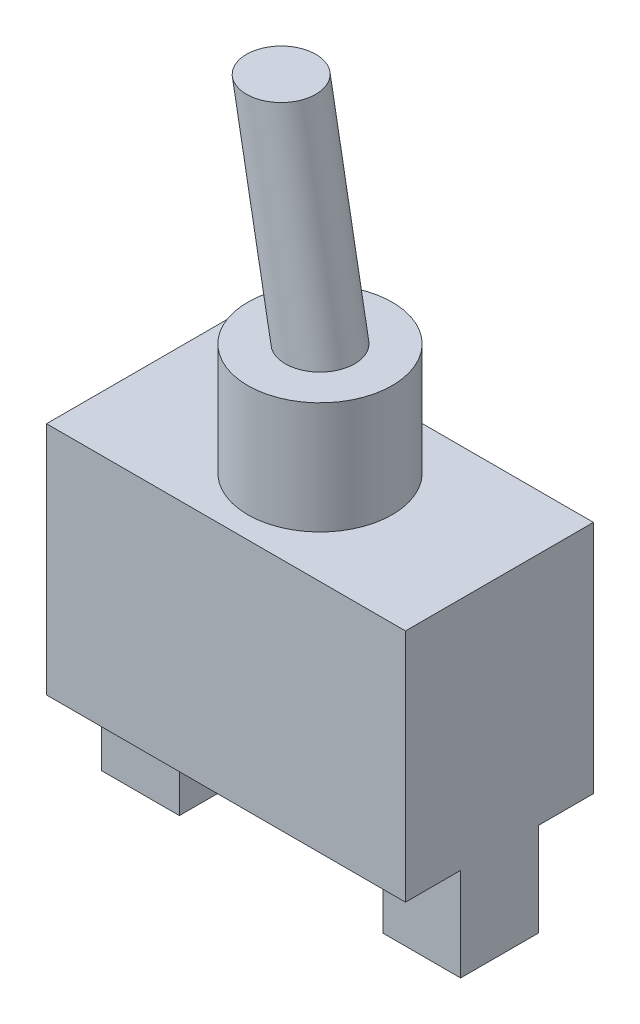
ISO-10303-21;
HEADER;
FILE_DESCRIPTION(('STEP AP214'),'2;1');
FILE_NAME('part.step','',(''),(''),'','','');
FILE_SCHEMA(('AUTOMOTIVE_DESIGN { 1 0 10303 214 1 1 1 1 }'));
ENDSEC;
DATA;
#1=APPLICATION_CONTEXT('core data for automotive mechanical design processes');
#2=APPLICATION_PROTOCOL_DEFINITION('international standard','automotive_design',2000,#1);
#3=PRODUCT_CONTEXT('',#1,'mechanical');
#4=PRODUCT('Part','Part','',(#3));
#5=PRODUCT_RELATED_PRODUCT_CATEGORY('part','',(#4));
#6=PRODUCT_DEFINITION_FORMATION('','',#4);
#7=PRODUCT_DEFINITION_CONTEXT('part definition',#1,'design');
#8=PRODUCT_DEFINITION('design','',#6,#7);
#9=PRODUCT_DEFINITION_SHAPE('','',#8);
#10=(LENGTH_UNIT() NAMED_UNIT(*) SI_UNIT(.MILLI.,.METRE.));
#11=(NAMED_UNIT(*) PLANE_ANGLE_UNIT() SI_UNIT($,.RADIAN.));
#12=(NAMED_UNIT(*) SI_UNIT($,.STERADIAN.) SOLID_ANGLE_UNIT());
#13=UNCERTAINTY_MEASURE_WITH_UNIT(LENGTH_MEASURE(1.E-05),#10,'distance_accuracy_value','');
#14=(GEOMETRIC_REPRESENTATION_CONTEXT(3) GLOBAL_UNCERTAINTY_ASSIGNED_CONTEXT((#13)) GLOBAL_UNIT_ASSIGNED_CONTEXT((#10,
#11,#12)) REPRESENTATION_CONTEXT('',''));
#15=CARTESIAN_POINT('',(0.,0.,0.));
#16=DIRECTION('',(0.,0.,1.));
#17=DIRECTION('',(1.,0.,0.));
#18=AXIS2_PLACEMENT_3D('',#15,#16,#17);
#19=CARTESIAN_POINT('',(0.,0.,0.));
#20=DIRECTION('',(0.,-1.,0.));
#21=DIRECTION('',(0.,0.,-1.));
#22=AXIS2_PLACEMENT_3D('',#19,#20,#21);
#23=PLANE('',#22);
#24=DIRECTION('',(0.,0.,-1.));
#25=VECTOR('',#24,1.);
#26=CARTESIAN_POINT('',(8.3185,0.,3.175));
#27=LINE('',#26,#25);
#28=CARTESIAN_POINT('',(8.3185,0.,3.175));
#29=VERTEX_POINT('',#28);
#30=CARTESIAN_POINT('',(8.3185,0.,-3.175));
#31=VERTEX_POINT('',#30);
#32=EDGE_CURVE('E439',#29,#31,#27,.T.);
#33=ORIENTED_EDGE('',*,*,#32,.F.);
#34=DIRECTION('',(-1.,0.,0.));
#35=VECTOR('',#34,1.);
#36=CARTESIAN_POINT('',(14.6685,0.,3.175));
#37=LINE('',#36,#35);
#38=CARTESIAN_POINT('',(14.6685,0.,3.175));
#39=VERTEX_POINT('',#38);
#40=EDGE_CURVE('E438',#39,#29,#37,.T.);
#41=ORIENTED_EDGE('',*,*,#40,.F.);
#42=DIRECTION('',(0.,0.,-1.));
#43=VECTOR('',#42,1.);
#44=CARTESIAN_POINT('',(14.6685,0.,7.6835));
#45=LINE('',#44,#43);
#46=CARTESIAN_POINT('',(14.6685,0.,7.6835));
#47=VERTEX_POINT('',#46);
#48=EDGE_CURVE('E157',#47,#39,#45,.T.);
#49=ORIENTED_EDGE('',*,*,#48,.F.);
#50=DIRECTION('',(1.,0.,0.));
#51=VECTOR('',#50,1.);
#52=CARTESIAN_POINT('',(-14.6685,0.,7.6835));
#53=LINE('',#52,#51);
#54=CARTESIAN_POINT('',(-14.6685,0.,7.6835));
#55=VERTEX_POINT('',#54);
#56=EDGE_CURVE('E215',#55,#47,#53,.T.);
#57=ORIENTED_EDGE('',*,*,#56,.F.);
#58=DIRECTION('',(0.,0.,1.));
#59=VECTOR('',#58,1.);
#60=CARTESIAN_POINT('',(-14.6685,0.,7.6835));
#61=LINE('',#60,#59);
#62=CARTESIAN_POINT('',(-14.6685,0.,3.175));
#63=VERTEX_POINT('',#62);
#64=EDGE_CURVE('E230',#63,#55,#61,.T.);
#65=ORIENTED_EDGE('',*,*,#64,.F.);
#66=DIRECTION('',(-1.,0.,0.));
#67=VECTOR('',#66,1.);
#68=CARTESIAN_POINT('',(-14.6685,0.,3.175));
#69=LINE('',#68,#67);
#70=CARTESIAN_POINT('',(-8.3185,0.,3.175));
#71=VERTEX_POINT('',#70);
#72=EDGE_CURVE('E65',#71,#63,#69,.T.);
#73=ORIENTED_EDGE('',*,*,#72,.F.);
#74=DIRECTION('',(0.,0.,1.));
#75=VECTOR('',#74,1.);
#76=CARTESIAN_POINT('',(-8.3185,0.,3.175));
#77=LINE('',#76,#75);
#78=CARTESIAN_POINT('',(-8.3185,0.,-3.175));
#79=VERTEX_POINT('',#78);
#80=EDGE_CURVE('E164',#79,#71,#77,.T.);
#81=ORIENTED_EDGE('',*,*,#80,.F.);
#82=DIRECTION('',(1.,0.,0.));
#83=VECTOR('',#82,1.);
#84=CARTESIAN_POINT('',(-14.6685,0.,-3.175));
#85=LINE('',#84,#83);
#86=CARTESIAN_POINT('',(-14.6685,0.,-3.175));
#87=VERTEX_POINT('',#86);
#88=EDGE_CURVE('E159',#87,#79,#85,.T.);
#89=ORIENTED_EDGE('',*,*,#88,.F.);
#90=CARTESIAN_POINT('',(-14.6685,0.,-7.6835));
#91=VERTEX_POINT('',#90);
#92=EDGE_CURVE('E231',#91,#87,#61,.T.);
#93=ORIENTED_EDGE('',*,*,#92,.F.);
#94=DIRECTION('',(-1.,0.,0.));
#95=VECTOR('',#94,1.);
#96=CARTESIAN_POINT('',(-14.6685,0.,-7.6835));
#97=LINE('',#96,#95);
#98=CARTESIAN_POINT('',(14.6685,0.,-7.6835));
#99=VERTEX_POINT('',#98);
#100=EDGE_CURVE('E227',#99,#91,#97,.T.);
#101=ORIENTED_EDGE('',*,*,#100,.F.);
#102=CARTESIAN_POINT('',(14.6685,0.,-3.175));
#103=VERTEX_POINT('',#102);
#104=EDGE_CURVE('E206',#103,#99,#45,.T.);
#105=ORIENTED_EDGE('',*,*,#104,.F.);
#106=DIRECTION('',(1.,0.,0.));
#107=VECTOR('',#106,1.);
#108=CARTESIAN_POINT('',(14.6685,0.,-3.175));
#109=LINE('',#108,#107);
#110=EDGE_CURVE('E152',#31,#103,#109,.T.);
#111=ORIENTED_EDGE('',*,*,#110,.F.);
#112=EDGE_LOOP('',(#33,#41,#49,#57,#65,#73,#81,#89,#93,#101,#105,#111));
#113=FACE_BOUND('',#112,.T.);
#114=ADVANCED_FACE('F39',(#113),#23,.T.);
#115=CARTESIAN_POINT('',(14.6685,19.2024,7.6835));
#116=DIRECTION('',(-1.,0.,0.));
#117=DIRECTION('',(0.,0.,1.));
#118=AXIS2_PLACEMENT_3D('',#115,#116,#117);
#119=PLANE('',#118);
#120=ORIENTED_EDGE('',*,*,#48,.T.);
#121=DIRECTION('',(0.,1.,0.));
#122=VECTOR('',#121,1.);
#123=CARTESIAN_POINT('',(14.6685,-7.62,3.175));
#124=LINE('',#123,#122);
#125=CARTESIAN_POINT('',(14.6685,-7.62,3.175));
#126=VERTEX_POINT('',#125);
#127=EDGE_CURVE('E135',#126,#39,#124,.T.);
#128=ORIENTED_EDGE('',*,*,#127,.F.);
#129=DIRECTION('',(0.,0.,1.));
#130=VECTOR('',#129,1.);
#131=CARTESIAN_POINT('',(14.6685,-7.62,3.175));
#132=LINE('',#131,#130);
#133=CARTESIAN_POINT('',(14.6685,-7.62,-3.175));
#134=VERTEX_POINT('',#133);
#135=EDGE_CURVE('E143',#134,#126,#132,.T.);
#136=ORIENTED_EDGE('',*,*,#135,.F.);
#137=DIRECTION('',(0.,1.,0.));
#138=VECTOR('',#137,1.);
#139=CARTESIAN_POINT('',(14.6685,-7.62,-3.175));
#140=LINE('',#139,#138);
#141=EDGE_CURVE('E257',#134,#103,#140,.T.);
#142=ORIENTED_EDGE('',*,*,#141,.T.);
#143=ORIENTED_EDGE('',*,*,#104,.T.);
#144=DIRECTION('',(0.,-1.,0.));
#145=VECTOR('',#144,1.);
#146=CARTESIAN_POINT('',(14.6685,19.2024,-7.6835));
#147=LINE('',#146,#145);
#148=CARTESIAN_POINT('',(14.6685,19.2024,-7.6835));
#149=VERTEX_POINT('',#148);
#150=EDGE_CURVE('E43',#149,#99,#147,.T.);
#151=ORIENTED_EDGE('',*,*,#150,.F.);
#152=DIRECTION('',(0.,0.,-1.));
#153=VECTOR('',#152,1.);
#154=CARTESIAN_POINT('',(14.6685,19.2024,7.6835));
#155=LINE('',#154,#153);
#156=CARTESIAN_POINT('',(14.6685,19.2024,7.6835));
#157=VERTEX_POINT('',#156);
#158=EDGE_CURVE('E210',#157,#149,#155,.T.);
#159=ORIENTED_EDGE('',*,*,#158,.F.);
#160=DIRECTION('',(0.,-1.,0.));
#161=VECTOR('',#160,1.);
#162=CARTESIAN_POINT('',(14.6685,19.2024,7.6835));
#163=LINE('',#162,#161);
#164=EDGE_CURVE('E224',#157,#47,#163,.T.);
#165=ORIENTED_EDGE('',*,*,#164,.T.);
#166=EDGE_LOOP('',(#120,#128,#136,#142,#143,#151,#159,#165));
#167=FACE_BOUND('',#166,.T.);
#168=ADVANCED_FACE('F41',(#167),#119,.F.);
#169=CARTESIAN_POINT('',(-14.6685,19.2024,-7.6835));
#170=DIRECTION('',(0.,0.,1.));
#171=DIRECTION('',(1.,0.,0.));
#172=AXIS2_PLACEMENT_3D('',#169,#170,#171);
#173=PLANE('',#172);
#174=ORIENTED_EDGE('',*,*,#100,.T.);
#175=DIRECTION('',(0.,-1.,0.));
#176=VECTOR('',#175,1.);
#177=CARTESIAN_POINT('',(-14.6685,19.2024,-7.6835));
#178=LINE('',#177,#176);
#179=CARTESIAN_POINT('',(-14.6685,19.2024,-7.6835));
#180=VERTEX_POINT('',#179);
#181=EDGE_CURVE('E242',#180,#91,#178,.T.);
#182=ORIENTED_EDGE('',*,*,#181,.F.);
#183=DIRECTION('',(-1.,0.,0.));
#184=VECTOR('',#183,1.);
#185=CARTESIAN_POINT('',(-14.6685,19.2024,-7.6835));
#186=LINE('',#185,#184);
#187=EDGE_CURVE('E214',#149,#180,#186,.T.);
#188=ORIENTED_EDGE('',*,*,#187,.F.);
#189=ORIENTED_EDGE('',*,*,#150,.T.);
#190=EDGE_LOOP('',(#174,#182,#188,#189));
#191=FACE_BOUND('',#190,.T.);
#192=ADVANCED_FACE('F253',(#191),#173,.F.);
#193=CARTESIAN_POINT('',(-14.6685,19.2024,7.6835));
#194=DIRECTION('',(1.,0.,0.));
#195=DIRECTION('',(0.,0.,-1.));
#196=AXIS2_PLACEMENT_3D('',#193,#194,#195);
#197=PLANE('',#196);
#198=ORIENTED_EDGE('',*,*,#92,.T.);
#199=DIRECTION('',(0.,1.,0.));
#200=VECTOR('',#199,1.);
#201=CARTESIAN_POINT('',(-14.6685,-7.62,-3.175));
#202=LINE('',#201,#200);
#203=CARTESIAN_POINT('',(-14.6685,-7.62,-3.175));
#204=VERTEX_POINT('',#203);
#205=EDGE_CURVE('E198',#204,#87,#202,.T.);
#206=ORIENTED_EDGE('',*,*,#205,.F.);
#207=DIRECTION('',(0.,0.,-1.));
#208=VECTOR('',#207,1.);
#209=CARTESIAN_POINT('',(-14.6685,-7.62,3.175));
#210=LINE('',#209,#208);
#211=CARTESIAN_POINT('',(-14.6685,-7.62,3.175));
#212=VERTEX_POINT('',#211);
#213=EDGE_CURVE('E169',#212,#204,#210,.T.);
#214=ORIENTED_EDGE('',*,*,#213,.F.);
#215=DIRECTION('',(0.,1.,0.));
#216=VECTOR('',#215,1.);
#217=CARTESIAN_POINT('',(-14.6685,-7.62,3.175));
#218=LINE('',#217,#216);
#219=EDGE_CURVE('E181',#212,#63,#218,.T.);
#220=ORIENTED_EDGE('',*,*,#219,.T.);
#221=ORIENTED_EDGE('',*,*,#64,.T.);
#222=DIRECTION('',(0.,-1.,0.));
#223=VECTOR('',#222,1.);
#224=CARTESIAN_POINT('',(-14.6685,19.2024,7.6835));
#225=LINE('',#224,#223);
#226=CARTESIAN_POINT('',(-14.6685,19.2024,7.6835));
#227=VERTEX_POINT('',#226);
#228=EDGE_CURVE('E239',#227,#55,#225,.T.);
#229=ORIENTED_EDGE('',*,*,#228,.F.);
#230=DIRECTION('',(0.,0.,1.));
#231=VECTOR('',#230,1.);
#232=CARTESIAN_POINT('',(-14.6685,19.2024,7.6835));
#233=LINE('',#232,#231);
#234=EDGE_CURVE('E218',#180,#227,#233,.T.);
#235=ORIENTED_EDGE('',*,*,#234,.F.);
#236=ORIENTED_EDGE('',*,*,#181,.T.);
#237=EDGE_LOOP('',(#198,#206,#214,#220,#221,#229,#235,#236));
#238=FACE_BOUND('',#237,.T.);
#239=ADVANCED_FACE('F262',(#238),#197,.F.);
#240=CARTESIAN_POINT('',(-14.6685,19.2024,7.6835));
#241=DIRECTION('',(0.,0.,-1.));
#242=DIRECTION('',(-1.,0.,0.));
#243=AXIS2_PLACEMENT_3D('',#240,#241,#242);
#244=PLANE('',#243);
#245=ORIENTED_EDGE('',*,*,#56,.T.);
#246=ORIENTED_EDGE('',*,*,#164,.F.);
#247=DIRECTION('',(1.,0.,0.));
#248=VECTOR('',#247,1.);
#249=CARTESIAN_POINT('',(-14.6685,19.2024,7.6835));
#250=LINE('',#249,#248);
#251=EDGE_CURVE('E221',#227,#157,#250,.T.);
#252=ORIENTED_EDGE('',*,*,#251,.F.);
#253=ORIENTED_EDGE('',*,*,#228,.T.);
#254=EDGE_LOOP('',(#245,#246,#252,#253));
#255=FACE_BOUND('',#254,.T.);
#256=ADVANCED_FACE('F296',(#255),#244,.F.);
#257=CARTESIAN_POINT('',(0.,19.2024,0.));
#258=DIRECTION('',(0.,-1.,0.));
#259=DIRECTION('',(0.,0.,-1.));
#260=AXIS2_PLACEMENT_3D('',#257,#258,#259);
#261=PLANE('',#260);
#262=CARTESIAN_POINT('',(0.,19.2024,0.));
#263=DIRECTION('',(0.,1.,0.));
#264=DIRECTION('',(0.,0.,1.));
#265=AXIS2_PLACEMENT_3D('',#262,#263,#264);
#266=CIRCLE('',#265,5.9055);
#267=CARTESIAN_POINT('',(0.,19.2024,5.9055));
#268=VERTEX_POINT('',#267);
#269=EDGE_CURVE('E49',#268,#268,#266,.T.);
#270=ORIENTED_EDGE('',*,*,#269,.F.);
#271=EDGE_LOOP('',(#270));
#272=FACE_BOUND('',#271,.T.);
#273=ORIENTED_EDGE('',*,*,#158,.T.);
#274=ORIENTED_EDGE('',*,*,#187,.T.);
#275=ORIENTED_EDGE('',*,*,#234,.T.);
#276=ORIENTED_EDGE('',*,*,#251,.T.);
#277=EDGE_LOOP('',(#273,#274,#275,#276));
#278=FACE_BOUND('',#277,.T.);
#279=ADVANCED_FACE('F294',(#272,#278),#261,.F.);
#280=CARTESIAN_POINT('',(0.,28.3464,0.));
#281=DIRECTION('',(0.,-1.,0.));
#282=DIRECTION('',(0.,0.,-1.));
#283=AXIS2_PLACEMENT_3D('',#280,#281,#282);
#284=CYLINDRICAL_SURFACE('',#283,5.9055);
#285=CARTESIAN_POINT('',(0.,28.3464,0.));
#286=DIRECTION('',(0.,1.,0.));
#287=DIRECTION('',(0.,0.,1.));
#288=AXIS2_PLACEMENT_3D('',#285,#286,#287);
#289=CIRCLE('',#288,5.9055);
#290=CARTESIAN_POINT('',(0.,28.3464,5.9055));
#291=VERTEX_POINT('',#290);
#292=EDGE_CURVE('E202',#291,#291,#289,.T.);
#293=ORIENTED_EDGE('',*,*,#292,.F.);
#294=EDGE_LOOP('',(#293));
#295=FACE_BOUND('',#294,.T.);
#296=ORIENTED_EDGE('',*,*,#269,.T.);
#297=EDGE_LOOP('',(#296));
#298=FACE_BOUND('',#297,.T.);
#299=ADVANCED_FACE('F321',(#295,#298),#284,.T.);
#300=CARTESIAN_POINT('',(0.,28.3464,0.));
#301=DIRECTION('',(0.,1.,0.));
#302=DIRECTION('',(0.,0.,1.));
#303=AXIS2_PLACEMENT_3D('',#300,#301,#302);
#304=PLANE('',#303);
#305=CARTESIAN_POINT('',(0.,28.3464,0.));
#306=DIRECTION('',(0.,1.,0.));
#307=DIRECTION('',(0.,0.,1.));
#308=AXIS2_PLACEMENT_3D('',#305,#306,#307);
#309=CIRCLE('',#308,2.8321);
#310=CARTESIAN_POINT('',(0.,28.3464,2.8321));
#311=VERTEX_POINT('',#310);
#312=EDGE_CURVE('E11',#311,#311,#309,.T.);
#313=ORIENTED_EDGE('',*,*,#312,.F.);
#314=EDGE_LOOP('',(#313));
#315=FACE_BOUND('',#314,.T.);
#316=ORIENTED_EDGE('',*,*,#292,.T.);
#317=EDGE_LOOP('',(#316));
#318=FACE_BOUND('',#317,.T.);
#319=ADVANCED_FACE('F285',(#315,#318),#304,.T.);
#320=CARTESIAN_POINT('',(-14.6685,-7.62,-3.175));
#321=DIRECTION('',(0.,0.,1.));
#322=DIRECTION('',(1.,0.,0.));
#323=AXIS2_PLACEMENT_3D('',#320,#321,#322);
#324=PLANE('',#323);
#325=ORIENTED_EDGE('',*,*,#88,.T.);
#326=DIRECTION('',(0.,1.,0.));
#327=VECTOR('',#326,1.);
#328=CARTESIAN_POINT('',(-8.3185,-7.62,-3.175));
#329=LINE('',#328,#327);
#330=CARTESIAN_POINT('',(-8.3185,-7.62,-3.175));
#331=VERTEX_POINT('',#330);
#332=EDGE_CURVE('E194',#331,#79,#329,.T.);
#333=ORIENTED_EDGE('',*,*,#332,.F.);
#334=DIRECTION('',(1.,0.,0.));
#335=VECTOR('',#334,1.);
#336=CARTESIAN_POINT('',(-14.6685,-7.62,-3.175));
#337=LINE('',#336,#335);
#338=EDGE_CURVE('E173',#204,#331,#337,.T.);
#339=ORIENTED_EDGE('',*,*,#338,.F.);
#340=ORIENTED_EDGE('',*,*,#205,.T.);
#341=EDGE_LOOP('',(#325,#333,#339,#340));
#342=FACE_BOUND('',#341,.T.);
#343=ADVANCED_FACE('F265',(#342),#324,.F.);
#344=CARTESIAN_POINT('',(-8.3185,-7.62,3.175));
#345=DIRECTION('',(-1.,0.,0.));
#346=DIRECTION('',(0.,0.,1.));
#347=AXIS2_PLACEMENT_3D('',#344,#345,#346);
#348=PLANE('',#347);
#349=ORIENTED_EDGE('',*,*,#80,.T.);
#350=DIRECTION('',(0.,1.,0.));
#351=VECTOR('',#350,1.);
#352=CARTESIAN_POINT('',(-8.3185,-7.62,3.175));
#353=LINE('',#352,#351);
#354=CARTESIAN_POINT('',(-8.3185,-7.62,3.175));
#355=VERTEX_POINT('',#354);
#356=EDGE_CURVE('E190',#355,#71,#353,.T.);
#357=ORIENTED_EDGE('',*,*,#356,.F.);
#358=DIRECTION('',(0.,0.,1.));
#359=VECTOR('',#358,1.);
#360=CARTESIAN_POINT('',(-8.3185,-7.62,3.175));
#361=LINE('',#360,#359);
#362=EDGE_CURVE('E176',#331,#355,#361,.T.);
#363=ORIENTED_EDGE('',*,*,#362,.F.);
#364=ORIENTED_EDGE('',*,*,#332,.T.);
#365=EDGE_LOOP('',(#349,#357,#363,#364));
#366=FACE_BOUND('',#365,.T.);
#367=ADVANCED_FACE('F277',(#366),#348,.F.);
#368=CARTESIAN_POINT('',(-14.6685,-7.62,3.175));
#369=DIRECTION('',(0.,0.,-1.));
#370=DIRECTION('',(-1.,0.,0.));
#371=AXIS2_PLACEMENT_3D('',#368,#369,#370);
#372=PLANE('',#371);
#373=ORIENTED_EDGE('',*,*,#72,.T.);
#374=ORIENTED_EDGE('',*,*,#219,.F.);
#375=DIRECTION('',(-1.,0.,0.));
#376=VECTOR('',#375,1.);
#377=CARTESIAN_POINT('',(-14.6685,-7.62,3.175));
#378=LINE('',#377,#376);
#379=EDGE_CURVE('E179',#355,#212,#378,.T.);
#380=ORIENTED_EDGE('',*,*,#379,.F.);
#381=ORIENTED_EDGE('',*,*,#356,.T.);
#382=EDGE_LOOP('',(#373,#374,#380,#381));
#383=FACE_BOUND('',#382,.T.);
#384=ADVANCED_FACE('F274',(#383),#372,.F.);
#385=CARTESIAN_POINT('',(0.,-7.62,0.));
#386=DIRECTION('',(0.,-1.,0.));
#387=DIRECTION('',(0.,0.,-1.));
#388=AXIS2_PLACEMENT_3D('',#385,#386,#387);
#389=PLANE('',#388);
#390=ORIENTED_EDGE('',*,*,#213,.T.);
#391=ORIENTED_EDGE('',*,*,#338,.T.);
#392=ORIENTED_EDGE('',*,*,#362,.T.);
#393=ORIENTED_EDGE('',*,*,#379,.T.);
#394=EDGE_LOOP('',(#390,#391,#392,#393));
#395=FACE_BOUND('',#394,.T.);
#396=ADVANCED_FACE('F269',(#395),#389,.T.);
#397=CARTESIAN_POINT('',(14.6685,-7.62,3.175));
#398=DIRECTION('',(0.,0.,-1.));
#399=DIRECTION('',(-1.,0.,0.));
#400=AXIS2_PLACEMENT_3D('',#397,#398,#399);
#401=PLANE('',#400);
#402=ORIENTED_EDGE('',*,*,#40,.T.);
#403=DIRECTION('',(0.,1.,0.));
#404=VECTOR('',#403,1.);
#405=CARTESIAN_POINT('',(8.3185,-7.62,3.175));
#406=LINE('',#405,#404);
#407=CARTESIAN_POINT('',(8.3185,-7.62,3.175));
#408=VERTEX_POINT('',#407);
#409=EDGE_CURVE('E138',#408,#29,#406,.T.);
#410=ORIENTED_EDGE('',*,*,#409,.F.);
#411=DIRECTION('',(-1.,0.,0.));
#412=VECTOR('',#411,1.);
#413=CARTESIAN_POINT('',(14.6685,-7.62,3.175));
#414=LINE('',#413,#412);
#415=EDGE_CURVE('E131',#126,#408,#414,.T.);
#416=ORIENTED_EDGE('',*,*,#415,.F.);
#417=ORIENTED_EDGE('',*,*,#127,.T.);
#418=EDGE_LOOP('',(#402,#410,#416,#417));
#419=FACE_BOUND('',#418,.T.);
#420=ADVANCED_FACE('F133',(#419),#401,.F.);
#421=CARTESIAN_POINT('',(8.3185,-7.62,3.175));
#422=DIRECTION('',(1.,0.,0.));
#423=DIRECTION('',(0.,0.,-1.));
#424=AXIS2_PLACEMENT_3D('',#421,#422,#423);
#425=PLANE('',#424);
#426=ORIENTED_EDGE('',*,*,#32,.T.);
#427=DIRECTION('',(0.,1.,0.));
#428=VECTOR('',#427,1.);
#429=CARTESIAN_POINT('',(8.3185,-7.62,-3.175));
#430=LINE('',#429,#428);
#431=CARTESIAN_POINT('',(8.3185,-7.62,-3.175));
#432=VERTEX_POINT('',#431);
#433=EDGE_CURVE('E57',#432,#31,#430,.T.);
#434=ORIENTED_EDGE('',*,*,#433,.F.);
#435=DIRECTION('',(0.,0.,-1.));
#436=VECTOR('',#435,1.);
#437=CARTESIAN_POINT('',(8.3185,-7.62,3.175));
#438=LINE('',#437,#436);
#439=EDGE_CURVE('E142',#408,#432,#438,.T.);
#440=ORIENTED_EDGE('',*,*,#439,.F.);
#441=ORIENTED_EDGE('',*,*,#409,.T.);
#442=EDGE_LOOP('',(#426,#434,#440,#441));
#443=FACE_BOUND('',#442,.T.);
#444=ADVANCED_FACE('F370',(#443),#425,.F.);
#445=CARTESIAN_POINT('',(14.6685,-7.62,-3.175));
#446=DIRECTION('',(0.,0.,1.));
#447=DIRECTION('',(1.,0.,0.));
#448=AXIS2_PLACEMENT_3D('',#445,#446,#447);
#449=PLANE('',#448);
#450=ORIENTED_EDGE('',*,*,#110,.T.);
#451=ORIENTED_EDGE('',*,*,#141,.F.);
#452=DIRECTION('',(1.,0.,0.));
#453=VECTOR('',#452,1.);
#454=CARTESIAN_POINT('',(14.6685,-7.62,-3.175));
#455=LINE('',#454,#453);
#456=EDGE_CURVE('E147',#432,#134,#455,.T.);
#457=ORIENTED_EDGE('',*,*,#456,.F.);
#458=ORIENTED_EDGE('',*,*,#433,.T.);
#459=EDGE_LOOP('',(#450,#451,#457,#458));
#460=FACE_BOUND('',#459,.T.);
#461=ADVANCED_FACE('F379',(#460),#449,.F.);
#462=CARTESIAN_POINT('',(0.,-7.62,0.));
#463=DIRECTION('',(0.,1.,0.));
#464=DIRECTION('',(0.,0.,1.));
#465=AXIS2_PLACEMENT_3D('',#462,#463,#464);
#466=PLANE('',#465);
#467=ORIENTED_EDGE('',*,*,#135,.T.);
#468=ORIENTED_EDGE('',*,*,#415,.T.);
#469=ORIENTED_EDGE('',*,*,#439,.T.);
#470=ORIENTED_EDGE('',*,*,#456,.T.);
#471=EDGE_LOOP('',(#467,#468,#469,#470));
#472=FACE_BOUND('',#471,.T.);
#473=ADVANCED_FACE('F146',(#472),#466,.F.);
#474=CARTESIAN_POINT('',(-3.175,45.840621188724,0.));
#475=DIRECTION('',(0.,1.,0.));
#476=DIRECTION('',(0.,0.,1.));
#477=AXIS2_PLACEMENT_3D('',#474,#475,#476);
#478=PLANE('',#477);
#479=CARTESIAN_POINT('',(-3.175,45.840621188724,0.));
#480=DIRECTION('',(0.,1.,0.));
#481=DIRECTION('',(0.,0.,1.));
#482=AXIS2_PLACEMENT_3D('',#479,#480,#481);
#483=CIRCLE('',#482,2.8321);
#484=CARTESIAN_POINT('',(-3.175,45.840621188724,2.8321));
#485=VERTEX_POINT('',#484);
#486=EDGE_CURVE('E428',#485,#485,#483,.T.);
#487=ORIENTED_EDGE('',*,*,#486,.T.);
#488=EDGE_LOOP('',(#487));
#489=FACE_BOUND('',#488,.T.);
#490=ADVANCED_FACE('F395',(#489),#478,.T.);
#491=CARTESIAN_POINT('',(0.,28.3464,2.8321));
#492=CARTESIAN_POINT('',(-3.175,45.840621188724,2.8321));
#493=CARTESIAN_POINT('',(5.6642,28.3464,2.8321));
#494=CARTESIAN_POINT('',(2.4892,45.840621188724,2.8321));
#495=CARTESIAN_POINT('',(5.6642,28.3464,-2.8321));
#496=CARTESIAN_POINT('',(2.4892,45.840621188724,-2.8321));
#497=CARTESIAN_POINT('',(0.,28.3464,-2.8321));
#498=CARTESIAN_POINT('',(-3.175,45.840621188724,-2.8321));
#499=CARTESIAN_POINT('',(-5.6642,28.3464,-2.8321));
#500=CARTESIAN_POINT('',(-8.8392,45.840621188724,-2.8321));
#501=CARTESIAN_POINT('',(-5.6642,28.3464,2.8321));
#502=CARTESIAN_POINT('',(-8.8392,45.840621188724,2.8321));
#503=CARTESIAN_POINT('',(0.,28.3464,2.8321));
#504=CARTESIAN_POINT('',(-3.175,45.840621188724,2.8321));
#505=(BOUNDED_SURFACE() B_SPLINE_SURFACE(3,1,((#491,#492),(#493,#494),(#495,#496),(#497,#498),
(#499,#500),(#501,#502),(#503,#504)),.UNSPECIFIED.,.T.,.F.,.F.) B_SPLINE_SURFACE_WITH_KNOTS((4,
3,4),(2,2),(0.,0.5,1.),(0.,1.),
.UNSPECIFIED.) GEOMETRIC_REPRESENTATION_ITEM() RATIONAL_B_SPLINE_SURFACE(((1.,1.),
(0.333333333333333,0.333333333333333),(0.333333333333333,0.333333333333333),(1.,1.),
(0.333333333333333,0.333333333333333),(0.333333333333333,0.333333333333333),(1.,1.))) REPRESENTATION_ITEM('') SURFACE());
#506=CARTESIAN_POINT('',(-3.175,45.840621188724,2.8321));
#507=CARTESIAN_POINT('',(-3.14192708333334,45.6583897180081,2.8321));
#508=CARTESIAN_POINT('',(-3.10885416666667,45.4761582472923,2.8321));
#509=CARTESIAN_POINT('',(-3.04270833333334,45.1116953058605,2.8321));
#510=CARTESIAN_POINT('',(-3.00963541666667,44.9294638351446,2.8321));
#511=CARTESIAN_POINT('',(-2.94348958333334,44.5650008937129,2.8321));
#512=CARTESIAN_POINT('',(-2.91041666666667,44.382769422997,2.8321));
#513=CARTESIAN_POINT('',(-2.84427083333334,44.0183064815653,2.8321));
#514=CARTESIAN_POINT('',(-2.81119791666667,43.8360750108494,2.8321));
#515=CARTESIAN_POINT('',(-2.74505208333334,43.4716120694176,2.8321));
#516=CARTESIAN_POINT('',(-2.71197916666667,43.2893805987017,2.8321));
#517=CARTESIAN_POINT('',(-2.64583333333333,42.92491765727,2.8321));
#518=CARTESIAN_POINT('',(-2.61276041666667,42.7426861865541,2.8321));
#519=CARTESIAN_POINT('',(-2.54661458333334,42.3782232451224,2.8321));
#520=CARTESIAN_POINT('',(-2.51354166666667,42.1959917744065,2.8321));
#521=CARTESIAN_POINT('',(-2.44739583333333,41.8315288329748,2.8321));
#522=CARTESIAN_POINT('',(-2.41432291666667,41.6492973622589,2.8321));
#523=CARTESIAN_POINT('',(-2.34817708333334,41.2848344208271,2.8321));
#524=CARTESIAN_POINT('',(-2.31510416666667,41.1026029501112,2.8321));
#525=CARTESIAN_POINT('',(-2.24895833333333,40.7381400086795,2.8321));
#526=CARTESIAN_POINT('',(-2.21588541666667,40.5559085379636,2.8321));
#527=CARTESIAN_POINT('',(-2.14973958333334,40.1914455965319,2.8321));
#528=CARTESIAN_POINT('',(-2.11666666666667,40.009214125816,2.8321));
#529=CARTESIAN_POINT('',(-2.05052083333333,39.6447511843842,2.8321));
#530=CARTESIAN_POINT('',(-2.01744791666667,39.4625197136684,2.8321));
#531=CARTESIAN_POINT('',(-1.95130208333333,39.0980567722366,2.8321));
#532=CARTESIAN_POINT('',(-1.91822916666667,38.9158253015207,2.8321));
#533=CARTESIAN_POINT('',(-1.85208333333333,38.551362360089,2.8321));
#534=CARTESIAN_POINT('',(-1.81901041666667,38.3691308893731,2.8321));
#535=CARTESIAN_POINT('',(-1.75286458333333,38.0046679479414,2.8321));
#536=CARTESIAN_POINT('',(-1.71979166666667,37.8224364772255,2.8321));
#537=CARTESIAN_POINT('',(-1.65364583333333,37.4579735357937,2.8321));
#538=CARTESIAN_POINT('',(-1.62057291666667,37.2757420650779,2.8321));
#539=CARTESIAN_POINT('',(-1.55442708333333,36.9112791236461,2.8321));
#540=CARTESIAN_POINT('',(-1.52135416666667,36.7290476529302,2.8321));
#541=CARTESIAN_POINT('',(-1.45520833333333,36.3645847114985,2.8321));
#542=CARTESIAN_POINT('',(-1.42213541666667,36.1823532407826,2.8321));
#543=CARTESIAN_POINT('',(-1.35598958333333,35.8178902993509,2.8321));
#544=CARTESIAN_POINT('',(-1.32291666666667,35.635658828635,2.8321));
#545=CARTESIAN_POINT('',(-1.25677083333333,35.2711958872032,2.8321));
#546=CARTESIAN_POINT('',(-1.22369791666667,35.0889644164874,2.8321));
#547=CARTESIAN_POINT('',(-1.15755208333333,34.7245014750556,2.8321));
#548=CARTESIAN_POINT('',(-1.12447916666667,34.5422700043397,2.8321));
#549=CARTESIAN_POINT('',(-1.05833333333333,34.177807062908,2.8321));
#550=CARTESIAN_POINT('',(-1.02526041666667,33.9955755921921,2.8321));
#551=CARTESIAN_POINT('',(-0.959114583333334,33.6311126507604,2.8321));
#552=CARTESIAN_POINT('',(-0.926041666666667,33.4488811800445,2.8321));
#553=CARTESIAN_POINT('',(-0.859895833333334,33.0844182386127,2.8321));
#554=CARTESIAN_POINT('',(-0.826822916666667,32.9021867678969,2.8321));
#555=CARTESIAN_POINT('',(-0.760677083333334,32.5377238264651,2.8321));
#556=CARTESIAN_POINT('',(-0.727604166666667,32.3554923557492,2.8321));
#557=CARTESIAN_POINT('',(-0.661458333333334,31.9910294143175,2.8321));
#558=CARTESIAN_POINT('',(-0.628385416666667,31.8087979436016,2.8321));
#559=CARTESIAN_POINT('',(-0.562239583333334,31.4443350021699,2.8321));
#560=CARTESIAN_POINT('',(-0.529166666666667,31.262103531454,2.8321));
#561=CARTESIAN_POINT('',(-0.463020833333333,30.8976405900222,2.8321));
#562=CARTESIAN_POINT('',(-0.429947916666667,30.7154091193064,2.8321));
#563=CARTESIAN_POINT('',(-0.363802083333334,30.3509461778746,2.8321));
#564=CARTESIAN_POINT('',(-0.330729166666667,30.1687147071587,2.8321));
#565=CARTESIAN_POINT('',(-0.264583333333333,29.804251765727,2.8321));
#566=CARTESIAN_POINT('',(-0.231510416666667,29.6220202950111,2.8321));
#567=CARTESIAN_POINT('',(-0.165364583333333,29.2575573535794,2.8321));
#568=CARTESIAN_POINT('',(-0.132291666666667,29.0753258828635,2.8321));
#569=CARTESIAN_POINT('',(-0.0661458333333334,28.7108629414317,2.8321));
#570=CARTESIAN_POINT('',(-0.0330729166666667,28.5286314707159,2.8321));
#571=CARTESIAN_POINT('',(0.,28.3464,2.8321));
#572=B_SPLINE_CURVE_WITH_KNOTS('',3,(#506,#507,#508,#509,#510,#511,#512,#513,#514,#515,#516,
#517,#518,#519,#520,#521,#522,#523,#524,#525,#526,#527,#528,#529,#530,#531,#532,#533,#534,#535,
#536,#537,#538,#539,#540,#541,#542,#543,#544,#545,#546,#547,#548,#549,#550,#551,#552,#553,#554,
#555,#556,#557,#558,#559,#560,#561,#562,#563,#564,#565,#566,#567,#568,#569,#570,#571),
.UNSPECIFIED.,.F.,.F.,(4,2,2,2,2,2,2,2,2,2,2,2,2,2,2,2,2,2,2,2,2,2,2,2,2,2,2,2,2,2,2,2,4),(0.,
0.555624999999997,1.11125,1.666875,2.2225,2.778125,3.33375,3.889375,4.445,5.000625,5.55625,
6.111875,6.6675,7.223125,7.77875,8.334375,8.89,9.445625,10.00125,10.556875,11.1125,11.668125,
12.22375,12.779375,13.335,13.890625,14.44625,15.001875,15.5575,16.113125,16.66875,17.224375,
17.78),.UNSPECIFIED.);
#573=EDGE_CURVE('',#485,#311,#572,.T.);
#574=ORIENTED_EDGE('',*,*,#486,.F.);
#575=ORIENTED_EDGE('',*,*,#312,.T.);
#576=ORIENTED_EDGE('',*,*,#573,.T.);
#577=ORIENTED_EDGE('',*,*,#573,.F.);
#578=EDGE_LOOP('',(#574,#576,#575,#577));
#579=FACE_BOUND('',#578,.T.);
#580=ADVANCED_FACE('F397',(#579),#505,.T.);
#581=CLOSED_SHELL('',(#114,#168,#192,#239,#256,#279,#299,#319,#343,#367,#384,#396,#420,#444,
#461,#473,#490,#580));
#582=MANIFOLD_SOLID_BREP('B2',#581);
#583=ADVANCED_BREP_SHAPE_REPRESENTATION('',(#18,#582),#14);
#584=SHAPE_DEFINITION_REPRESENTATION(#9,#583);
ENDSEC;
END-ISO-10303-21;
